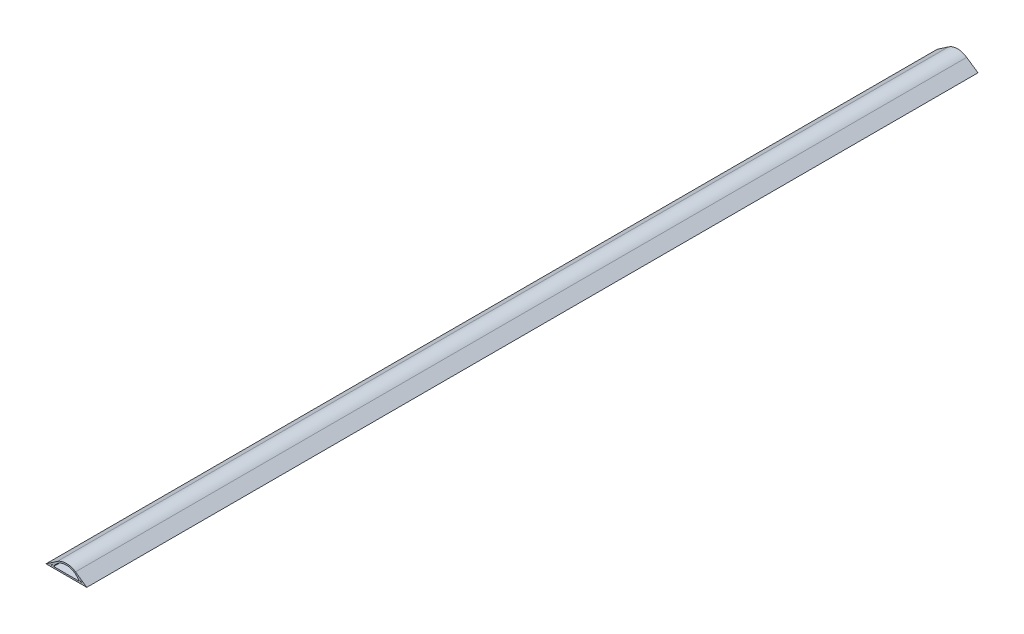
ISO-10303-21;
HEADER;
FILE_DESCRIPTION(('STEP AP214'),'2;1');
FILE_NAME('part.step','',(''),(''),'','','');
FILE_SCHEMA(('AUTOMOTIVE_DESIGN { 1 0 10303 214 1 1 1 1 }'));
ENDSEC;
DATA;
#1=APPLICATION_CONTEXT('core data for automotive mechanical design processes');
#2=APPLICATION_PROTOCOL_DEFINITION('international standard','automotive_design',2000,#1);
#3=PRODUCT_CONTEXT('',#1,'mechanical');
#4=PRODUCT('Part','Part','',(#3));
#5=PRODUCT_RELATED_PRODUCT_CATEGORY('part','',(#4));
#6=PRODUCT_DEFINITION_FORMATION('','',#4);
#7=PRODUCT_DEFINITION_CONTEXT('part definition',#1,'design');
#8=PRODUCT_DEFINITION('design','',#6,#7);
#9=PRODUCT_DEFINITION_SHAPE('','',#8);
#10=(LENGTH_UNIT() NAMED_UNIT(*) SI_UNIT(.MILLI.,.METRE.));
#11=(NAMED_UNIT(*) PLANE_ANGLE_UNIT() SI_UNIT($,.RADIAN.));
#12=(NAMED_UNIT(*) SI_UNIT($,.STERADIAN.) SOLID_ANGLE_UNIT());
#13=UNCERTAINTY_MEASURE_WITH_UNIT(LENGTH_MEASURE(1.E-05),#10,'distance_accuracy_value','');
#14=(GEOMETRIC_REPRESENTATION_CONTEXT(3) GLOBAL_UNCERTAINTY_ASSIGNED_CONTEXT((#13)) GLOBAL_UNIT_ASSIGNED_CONTEXT((#10,
#11,#12)) REPRESENTATION_CONTEXT('',''));
#15=CARTESIAN_POINT('',(0.,0.,0.));
#16=DIRECTION('',(0.,0.,1.));
#17=DIRECTION('',(1.,0.,0.));
#18=AXIS2_PLACEMENT_3D('',#15,#16,#17);
#19=CARTESIAN_POINT('',(34.29,-9.25285714285715,1498.6));
#20=DIRECTION('',(0.,0.,1.));
#21=DIRECTION('',(1.,0.,0.));
#22=AXIS2_PLACEMENT_3D('',#19,#20,#21);
#23=PLANE('',#22);
#24=CARTESIAN_POINT('',(34.29,-9.25285714285715,1498.6));
#25=DIRECTION('',(0.,0.,1.));
#26=DIRECTION('',(1.,0.,0.));
#27=AXIS2_PLACEMENT_3D('',#24,#25,#26);
#28=CIRCLE('',#27,27.0328571428572);
#29=CARTESIAN_POINT('',(49.5873201432242,13.0354214300123,1498.6));
#30=VERTEX_POINT('',#29);
#31=CARTESIAN_POINT('',(18.9926798567758,13.0354214300123,1498.6));
#32=VERTEX_POINT('',#31);
#33=EDGE_CURVE('E187',#30,#32,#28,.T.);
#34=ORIENTED_EDGE('',*,*,#33,.T.);
#35=DIRECTION('',(-0.824488453258394,-0.565878777163079,0.));
#36=VECTOR('',#35,1.);
#37=CARTESIAN_POINT('',(18.9926798567758,13.0354214300123,1498.6));
#38=LINE('',#37,#36);
#39=CARTESIAN_POINT('',(0.,0.,1498.6));
#40=VERTEX_POINT('',#39);
#41=EDGE_CURVE('E190',#32,#40,#38,.T.);
#42=ORIENTED_EDGE('',*,*,#41,.T.);
#43=DIRECTION('',(1.,0.,0.));
#44=VECTOR('',#43,1.);
#45=CARTESIAN_POINT('',(0.,0.,1498.6));
#46=LINE('',#45,#44);
#47=CARTESIAN_POINT('',(68.58,0.,1498.6));
#48=VERTEX_POINT('',#47);
#49=EDGE_CURVE('E193',#40,#48,#46,.T.);
#50=ORIENTED_EDGE('',*,*,#49,.T.);
#51=DIRECTION('',(-0.824488453258394,0.565878777163079,0.));
#52=VECTOR('',#51,1.);
#53=CARTESIAN_POINT('',(49.5873201432242,13.0354214300123,1498.6));
#54=LINE('',#53,#52);
#55=EDGE_CURVE('E195',#48,#30,#54,.T.);
#56=ORIENTED_EDGE('',*,*,#55,.T.);
#57=EDGE_LOOP('',(#34,#42,#50,#56));
#58=FACE_BOUND('',#57,.T.);
#59=CARTESIAN_POINT('',(34.29,-9.25285714285715,1498.6));
#60=DIRECTION('',(0.,0.,-1.));
#61=DIRECTION('',(1.,0.,0.));
#62=AXIS2_PLACEMENT_3D('',#59,#60,#61);
#63=CIRCLE('',#62,27.0328571428572);
#64=CARTESIAN_POINT('',(9.9650357510173,2.54,1498.6));
#65=VERTEX_POINT('',#64);
#66=CARTESIAN_POINT('',(10.9978022708371,4.46752514961934,1498.6));
#67=VERTEX_POINT('',#66);
#68=EDGE_CURVE('E165',#65,#67,#63,.T.);
#69=ORIENTED_EDGE('',*,*,#68,.F.);
#70=DIRECTION('',(1.,0.,0.));
#71=VECTOR('',#70,1.);
#72=CARTESIAN_POINT('',(8.18938765385225,2.54,1498.6));
#73=LINE('',#72,#71);
#74=CARTESIAN_POINT('',(8.18938765385225,2.54,1498.6));
#75=VERTEX_POINT('',#74);
#76=EDGE_CURVE('E163',#75,#65,#73,.T.);
#77=ORIENTED_EDGE('',*,*,#76,.F.);
#78=DIRECTION('',(-0.824488453258395,-0.565878777163076,0.));
#79=VECTOR('',#78,1.);
#80=CARTESIAN_POINT('',(10.9978022708371,4.46752514961934,1498.6));
#81=LINE('',#80,#79);
#82=EDGE_CURVE('E169',#67,#75,#81,.T.);
#83=ORIENTED_EDGE('',*,*,#82,.F.);
#84=EDGE_LOOP('',(#69,#77,#83));
#85=FACE_BOUND('',#84,.T.);
#86=DIRECTION('',(-0.824488453258395,0.565878777163076,0.));
#87=VECTOR('',#86,1.);
#88=CARTESIAN_POINT('',(57.5821977291629,4.46752514961935,1498.6));
#89=LINE('',#88,#87);
#90=CARTESIAN_POINT('',(60.3906123461478,2.54,1498.6));
#91=VERTEX_POINT('',#90);
#92=CARTESIAN_POINT('',(57.5821977291629,4.46752514961936,1498.6));
#93=VERTEX_POINT('',#92);
#94=EDGE_CURVE('E141',#91,#93,#89,.T.);
#95=ORIENTED_EDGE('',*,*,#94,.F.);
#96=DIRECTION('',(1.,0.,0.));
#97=VECTOR('',#96,1.);
#98=CARTESIAN_POINT('',(58.6149642489827,2.54,1498.6));
#99=LINE('',#98,#97);
#100=CARTESIAN_POINT('',(58.6149642489827,2.54,1498.6));
#101=VERTEX_POINT('',#100);
#102=EDGE_CURVE('E139',#101,#91,#99,.T.);
#103=ORIENTED_EDGE('',*,*,#102,.F.);
#104=CARTESIAN_POINT('',(34.29,-9.25285714285715,1498.6));
#105=DIRECTION('',(0.,0.,-1.));
#106=DIRECTION('',(1.,0.,0.));
#107=AXIS2_PLACEMENT_3D('',#104,#105,#106);
#108=CIRCLE('',#107,27.0328571428572);
#109=EDGE_CURVE('E145',#93,#101,#108,.T.);
#110=ORIENTED_EDGE('',*,*,#109,.F.);
#111=EDGE_LOOP('',(#95,#103,#110));
#112=FACE_BOUND('',#111,.T.);
#113=DIRECTION('',(1.,0.,0.));
#114=VECTOR('',#113,1.);
#115=CARTESIAN_POINT('',(12.8230819298957,2.54,1498.6));
#116=LINE('',#115,#114);
#117=CARTESIAN_POINT('',(12.8230819298957,2.54,1498.6));
#118=VERTEX_POINT('',#117);
#119=CARTESIAN_POINT('',(55.7569180701043,2.54,1498.6));
#120=VERTEX_POINT('',#119);
#121=EDGE_CURVE('E122',#118,#120,#116,.T.);
#122=ORIENTED_EDGE('',*,*,#121,.F.);
#123=CARTESIAN_POINT('',(34.29,-9.25285714285715,1498.6));
#124=DIRECTION('',(0.,0.,1.));
#125=DIRECTION('',(1.,0.,0.));
#126=AXIS2_PLACEMENT_3D('',#123,#124,#125);
#127=CIRCLE('',#126,24.4928571428572);
#128=EDGE_CURVE('E128',#120,#118,#127,.T.);
#129=ORIENTED_EDGE('',*,*,#128,.F.);
#130=EDGE_LOOP('',(#122,#129));
#131=FACE_BOUND('',#130,.T.);
#132=ADVANCED_FACE('F34',(#58,#85,#112,#131),#23,.T.);
#133=CARTESIAN_POINT('',(34.29,-9.25285714285715,0.));
#134=DIRECTION('',(0.,0.,1.));
#135=DIRECTION('',(1.,0.,0.));
#136=AXIS2_PLACEMENT_3D('',#133,#134,#135);
#137=PLANE('',#136);
#138=DIRECTION('',(1.,0.,0.));
#139=VECTOR('',#138,1.);
#140=CARTESIAN_POINT('',(58.6149642489827,2.54,0.));
#141=LINE('',#140,#139);
#142=CARTESIAN_POINT('',(58.6149642489827,2.53999999999999,0.));
#143=VERTEX_POINT('',#142);
#144=CARTESIAN_POINT('',(60.3906123461478,2.54,0.));
#145=VERTEX_POINT('',#144);
#146=EDGE_CURVE('E138',#143,#145,#141,.T.);
#147=ORIENTED_EDGE('',*,*,#146,.T.);
#148=DIRECTION('',(-0.824488453258395,0.565878777163076,0.));
#149=VECTOR('',#148,1.);
#150=CARTESIAN_POINT('',(57.5821977291629,4.46752514961935,0.));
#151=LINE('',#150,#149);
#152=CARTESIAN_POINT('',(57.5821977291629,4.46752514961935,0.));
#153=VERTEX_POINT('',#152);
#154=EDGE_CURVE('E150',#145,#153,#151,.T.);
#155=ORIENTED_EDGE('',*,*,#154,.T.);
#156=CARTESIAN_POINT('',(34.29,-9.25285714285715,0.));
#157=DIRECTION('',(0.,0.,-1.));
#158=DIRECTION('',(1.,0.,0.));
#159=AXIS2_PLACEMENT_3D('',#156,#157,#158);
#160=CIRCLE('',#159,27.0328571428572);
#161=EDGE_CURVE('E142',#153,#143,#160,.T.);
#162=ORIENTED_EDGE('',*,*,#161,.T.);
#163=EDGE_LOOP('',(#147,#155,#162));
#164=FACE_BOUND('',#163,.T.);
#165=CARTESIAN_POINT('',(34.29,-9.25285714285715,0.));
#166=DIRECTION('',(0.,0.,1.));
#167=DIRECTION('',(1.,0.,0.));
#168=AXIS2_PLACEMENT_3D('',#165,#166,#167);
#169=CIRCLE('',#168,27.0328571428572);
#170=CARTESIAN_POINT('',(49.5873201432242,13.0354214300123,0.));
#171=VERTEX_POINT('',#170);
#172=CARTESIAN_POINT('',(18.9926798567758,13.0354214300123,0.));
#173=VERTEX_POINT('',#172);
#174=EDGE_CURVE('E186',#171,#173,#169,.T.);
#175=ORIENTED_EDGE('',*,*,#174,.F.);
#176=DIRECTION('',(-0.824488453258394,0.565878777163079,0.));
#177=VECTOR('',#176,1.);
#178=CARTESIAN_POINT('',(49.5873201432242,13.0354214300123,0.));
#179=LINE('',#178,#177);
#180=CARTESIAN_POINT('',(68.58,0.,0.));
#181=VERTEX_POINT('',#180);
#182=EDGE_CURVE('E191',#181,#171,#179,.T.);
#183=ORIENTED_EDGE('',*,*,#182,.F.);
#184=DIRECTION('',(1.,0.,0.));
#185=VECTOR('',#184,1.);
#186=CARTESIAN_POINT('',(0.,0.,0.));
#187=LINE('',#186,#185);
#188=CARTESIAN_POINT('',(0.,0.,0.));
#189=VERTEX_POINT('',#188);
#190=EDGE_CURVE('E202',#189,#181,#187,.T.);
#191=ORIENTED_EDGE('',*,*,#190,.F.);
#192=DIRECTION('',(-0.824488453258394,-0.565878777163079,0.));
#193=VECTOR('',#192,1.);
#194=CARTESIAN_POINT('',(18.9926798567758,13.0354214300123,0.));
#195=LINE('',#194,#193);
#196=EDGE_CURVE('E200',#173,#189,#195,.T.);
#197=ORIENTED_EDGE('',*,*,#196,.F.);
#198=EDGE_LOOP('',(#175,#183,#191,#197));
#199=FACE_BOUND('',#198,.T.);
#200=DIRECTION('',(1.,0.,0.));
#201=VECTOR('',#200,1.);
#202=CARTESIAN_POINT('',(8.18938765385225,2.54,0.));
#203=LINE('',#202,#201);
#204=CARTESIAN_POINT('',(8.18938765385225,2.54,0.));
#205=VERTEX_POINT('',#204);
#206=CARTESIAN_POINT('',(9.9650357510173,2.54,0.));
#207=VERTEX_POINT('',#206);
#208=EDGE_CURVE('E162',#205,#207,#203,.T.);
#209=ORIENTED_EDGE('',*,*,#208,.T.);
#210=CARTESIAN_POINT('',(34.29,-9.25285714285715,0.));
#211=DIRECTION('',(0.,0.,-1.));
#212=DIRECTION('',(1.,0.,0.));
#213=AXIS2_PLACEMENT_3D('',#210,#211,#212);
#214=CIRCLE('',#213,27.0328571428572);
#215=CARTESIAN_POINT('',(10.9978022708371,4.46752514961934,0.));
#216=VERTEX_POINT('',#215);
#217=EDGE_CURVE('E174',#207,#216,#214,.T.);
#218=ORIENTED_EDGE('',*,*,#217,.T.);
#219=DIRECTION('',(-0.824488453258395,-0.565878777163076,0.));
#220=VECTOR('',#219,1.);
#221=CARTESIAN_POINT('',(10.9978022708371,4.46752514961934,0.));
#222=LINE('',#221,#220);
#223=EDGE_CURVE('E166',#216,#205,#222,.T.);
#224=ORIENTED_EDGE('',*,*,#223,.T.);
#225=EDGE_LOOP('',(#209,#218,#224));
#226=FACE_BOUND('',#225,.T.);
#227=CARTESIAN_POINT('',(34.29,-9.25285714285715,0.));
#228=DIRECTION('',(0.,0.,1.));
#229=DIRECTION('',(1.,0.,0.));
#230=AXIS2_PLACEMENT_3D('',#227,#228,#229);
#231=CIRCLE('',#230,24.4928571428572);
#232=CARTESIAN_POINT('',(55.7569180701043,2.54,0.));
#233=VERTEX_POINT('',#232);
#234=CARTESIAN_POINT('',(12.8230819298957,2.54,0.));
#235=VERTEX_POINT('',#234);
#236=EDGE_CURVE('E56',#233,#235,#231,.T.);
#237=ORIENTED_EDGE('',*,*,#236,.T.);
#238=DIRECTION('',(1.,0.,0.));
#239=VECTOR('',#238,1.);
#240=CARTESIAN_POINT('',(12.8230819298957,2.54,0.));
#241=LINE('',#240,#239);
#242=EDGE_CURVE('E132',#235,#233,#241,.T.);
#243=ORIENTED_EDGE('',*,*,#242,.T.);
#244=EDGE_LOOP('',(#237,#243));
#245=FACE_BOUND('',#244,.T.);
#246=ADVANCED_FACE('F220',(#164,#199,#226,#245),#137,.F.);
#247=CARTESIAN_POINT('',(34.29,-9.25285714285715,1498.6));
#248=DIRECTION('',(0.,0.,-1.));
#249=DIRECTION('',(-1.,0.,0.));
#250=AXIS2_PLACEMENT_3D('',#247,#248,#249);
#251=CYLINDRICAL_SURFACE('',#250,27.0328571428572);
#252=ORIENTED_EDGE('',*,*,#174,.T.);
#253=DIRECTION('',(0.,0.,-1.));
#254=VECTOR('',#253,1.);
#255=CARTESIAN_POINT('',(18.9926798567758,13.0354214300123,1498.6));
#256=LINE('',#255,#254);
#257=EDGE_CURVE('E11',#32,#173,#256,.T.);
#258=ORIENTED_EDGE('',*,*,#257,.F.);
#259=ORIENTED_EDGE('',*,*,#33,.F.);
#260=DIRECTION('',(0.,0.,-1.));
#261=VECTOR('',#260,1.);
#262=CARTESIAN_POINT('',(49.5873201432242,13.0354214300123,1498.6));
#263=LINE('',#262,#261);
#264=EDGE_CURVE('E197',#30,#171,#263,.T.);
#265=ORIENTED_EDGE('',*,*,#264,.T.);
#266=EDGE_LOOP('',(#252,#258,#259,#265));
#267=FACE_BOUND('',#266,.T.);
#268=ADVANCED_FACE('F36',(#267),#251,.T.);
#269=CARTESIAN_POINT('',(18.9926798567758,13.0354214300123,1498.6));
#270=DIRECTION('',(0.565878777163079,-0.824488453258394,0.));
#271=DIRECTION('',(0.824488453258394,0.565878777163079,0.));
#272=AXIS2_PLACEMENT_3D('',#269,#270,#271);
#273=PLANE('',#272);
#274=ORIENTED_EDGE('',*,*,#196,.T.);
#275=DIRECTION('',(0.,0.,-1.));
#276=VECTOR('',#275,1.);
#277=CARTESIAN_POINT('',(0.,0.,1498.6));
#278=LINE('',#277,#276);
#279=EDGE_CURVE('E42',#40,#189,#278,.T.);
#280=ORIENTED_EDGE('',*,*,#279,.F.);
#281=ORIENTED_EDGE('',*,*,#41,.F.);
#282=ORIENTED_EDGE('',*,*,#257,.T.);
#283=EDGE_LOOP('',(#274,#280,#281,#282));
#284=FACE_BOUND('',#283,.T.);
#285=ADVANCED_FACE('F231',(#284),#273,.F.);
#286=CARTESIAN_POINT('',(0.,0.,1498.6));
#287=DIRECTION('',(0.,1.,0.));
#288=DIRECTION('',(0.,0.,1.));
#289=AXIS2_PLACEMENT_3D('',#286,#287,#288);
#290=PLANE('',#289);
#291=ORIENTED_EDGE('',*,*,#190,.T.);
#292=DIRECTION('',(0.,0.,-1.));
#293=VECTOR('',#292,1.);
#294=CARTESIAN_POINT('',(68.58,0.,1498.6));
#295=LINE('',#294,#293);
#296=EDGE_CURVE('E207',#48,#181,#295,.T.);
#297=ORIENTED_EDGE('',*,*,#296,.F.);
#298=ORIENTED_EDGE('',*,*,#49,.F.);
#299=ORIENTED_EDGE('',*,*,#279,.T.);
#300=EDGE_LOOP('',(#291,#297,#298,#299));
#301=FACE_BOUND('',#300,.T.);
#302=ADVANCED_FACE('F214',(#301),#290,.F.);
#303=CARTESIAN_POINT('',(49.5873201432242,13.0354214300123,1498.6));
#304=DIRECTION('',(-0.565878777163079,-0.824488453258394,0.));
#305=DIRECTION('',(0.824488453258394,-0.565878777163079,0.));
#306=AXIS2_PLACEMENT_3D('',#303,#304,#305);
#307=PLANE('',#306);
#308=ORIENTED_EDGE('',*,*,#182,.T.);
#309=ORIENTED_EDGE('',*,*,#264,.F.);
#310=ORIENTED_EDGE('',*,*,#55,.F.);
#311=ORIENTED_EDGE('',*,*,#296,.T.);
#312=EDGE_LOOP('',(#308,#309,#310,#311));
#313=FACE_BOUND('',#312,.T.);
#314=ADVANCED_FACE('F224',(#313),#307,.F.);
#315=CARTESIAN_POINT('',(8.18938765385225,2.54,1498.6));
#316=DIRECTION('',(0.,1.,0.));
#317=DIRECTION('',(-1.,0.,0.));
#318=AXIS2_PLACEMENT_3D('',#315,#316,#317);
#319=PLANE('',#318);
#320=ORIENTED_EDGE('',*,*,#208,.F.);
#321=DIRECTION('',(0.,0.,-1.));
#322=VECTOR('',#321,1.);
#323=CARTESIAN_POINT('',(8.18938765385225,2.54,1498.6));
#324=LINE('',#323,#322);
#325=EDGE_CURVE('E171',#75,#205,#324,.T.);
#326=ORIENTED_EDGE('',*,*,#325,.F.);
#327=ORIENTED_EDGE('',*,*,#76,.T.);
#328=DIRECTION('',(0.,0.,-1.));
#329=VECTOR('',#328,1.);
#330=CARTESIAN_POINT('',(9.9650357510173,2.54,1498.6));
#331=LINE('',#330,#329);
#332=EDGE_CURVE('E183',#65,#207,#331,.T.);
#333=ORIENTED_EDGE('',*,*,#332,.T.);
#334=EDGE_LOOP('',(#320,#326,#327,#333));
#335=FACE_BOUND('',#334,.T.);
#336=ADVANCED_FACE('F246',(#335),#319,.T.);
#337=CARTESIAN_POINT('',(34.29,-9.25285714285715,1498.6));
#338=DIRECTION('',(0.,0.,-1.));
#339=DIRECTION('',(-1.,0.,0.));
#340=AXIS2_PLACEMENT_3D('',#337,#338,#339);
#341=CYLINDRICAL_SURFACE('',#340,27.0328571428572);
#342=ORIENTED_EDGE('',*,*,#217,.F.);
#343=ORIENTED_EDGE('',*,*,#332,.F.);
#344=ORIENTED_EDGE('',*,*,#68,.T.);
#345=DIRECTION('',(0.,0.,-1.));
#346=VECTOR('',#345,1.);
#347=CARTESIAN_POINT('',(10.9978022708371,4.46752514961934,1498.6));
#348=LINE('',#347,#346);
#349=EDGE_CURVE('E181',#67,#216,#348,.T.);
#350=ORIENTED_EDGE('',*,*,#349,.T.);
#351=EDGE_LOOP('',(#342,#343,#344,#350));
#352=FACE_BOUND('',#351,.T.);
#353=ADVANCED_FACE('F253',(#352),#341,.T.);
#354=CARTESIAN_POINT('',(10.9978022708371,4.46752514961934,1498.6));
#355=DIRECTION('',(0.565878777163076,-0.824488453258395,0.));
#356=DIRECTION('',(0.824488453258396,0.565878777163077,0.));
#357=AXIS2_PLACEMENT_3D('',#354,#355,#356);
#358=PLANE('',#357);
#359=ORIENTED_EDGE('',*,*,#223,.F.);
#360=ORIENTED_EDGE('',*,*,#349,.F.);
#361=ORIENTED_EDGE('',*,*,#82,.T.);
#362=ORIENTED_EDGE('',*,*,#325,.T.);
#363=EDGE_LOOP('',(#359,#360,#361,#362));
#364=FACE_BOUND('',#363,.T.);
#365=ADVANCED_FACE('F258',(#364),#358,.T.);
#366=CARTESIAN_POINT('',(58.6149642489827,2.54,1498.6));
#367=DIRECTION('',(0.,1.,0.));
#368=DIRECTION('',(-1.,0.,0.));
#369=AXIS2_PLACEMENT_3D('',#366,#367,#368);
#370=PLANE('',#369);
#371=ORIENTED_EDGE('',*,*,#146,.F.);
#372=DIRECTION('',(0.,0.,-1.));
#373=VECTOR('',#372,1.);
#374=CARTESIAN_POINT('',(58.6149642489827,2.54,1498.6));
#375=LINE('',#374,#373);
#376=EDGE_CURVE('E147',#101,#143,#375,.T.);
#377=ORIENTED_EDGE('',*,*,#376,.F.);
#378=ORIENTED_EDGE('',*,*,#102,.T.);
#379=DIRECTION('',(0.,0.,-1.));
#380=VECTOR('',#379,1.);
#381=CARTESIAN_POINT('',(60.3906123461478,2.54,1498.6));
#382=LINE('',#381,#380);
#383=EDGE_CURVE('E159',#91,#145,#382,.T.);
#384=ORIENTED_EDGE('',*,*,#383,.T.);
#385=EDGE_LOOP('',(#371,#377,#378,#384));
#386=FACE_BOUND('',#385,.T.);
#387=ADVANCED_FACE('F277',(#386),#370,.T.);
#388=CARTESIAN_POINT('',(57.5821977291629,4.46752514961935,1498.6));
#389=DIRECTION('',(-0.565878777163076,-0.824488453258395,0.));
#390=DIRECTION('',(0.824488453258396,-0.565878777163076,0.));
#391=AXIS2_PLACEMENT_3D('',#388,#389,#390);
#392=PLANE('',#391);
#393=ORIENTED_EDGE('',*,*,#154,.F.);
#394=ORIENTED_EDGE('',*,*,#383,.F.);
#395=ORIENTED_EDGE('',*,*,#94,.T.);
#396=DIRECTION('',(0.,0.,-1.));
#397=VECTOR('',#396,1.);
#398=CARTESIAN_POINT('',(57.5821977291629,4.46752514961935,1498.6));
#399=LINE('',#398,#397);
#400=EDGE_CURVE('E157',#93,#153,#399,.T.);
#401=ORIENTED_EDGE('',*,*,#400,.T.);
#402=EDGE_LOOP('',(#393,#394,#395,#401));
#403=FACE_BOUND('',#402,.T.);
#404=ADVANCED_FACE('F274',(#403),#392,.T.);
#405=CARTESIAN_POINT('',(34.29,-9.25285714285715,1498.6));
#406=DIRECTION('',(0.,0.,-1.));
#407=DIRECTION('',(-1.,0.,0.));
#408=AXIS2_PLACEMENT_3D('',#405,#406,#407);
#409=CYLINDRICAL_SURFACE('',#408,27.0328571428572);
#410=ORIENTED_EDGE('',*,*,#161,.F.);
#411=ORIENTED_EDGE('',*,*,#400,.F.);
#412=ORIENTED_EDGE('',*,*,#109,.T.);
#413=ORIENTED_EDGE('',*,*,#376,.T.);
#414=EDGE_LOOP('',(#410,#411,#412,#413));
#415=FACE_BOUND('',#414,.T.);
#416=ADVANCED_FACE('F280',(#415),#409,.T.);
#417=CARTESIAN_POINT('',(34.29,-9.25285714285715,1498.6));
#418=DIRECTION('',(0.,0.,-1.));
#419=DIRECTION('',(-1.,0.,0.));
#420=AXIS2_PLACEMENT_3D('',#417,#418,#419);
#421=CYLINDRICAL_SURFACE('',#420,24.4928571428572);
#422=ORIENTED_EDGE('',*,*,#236,.F.);
#423=DIRECTION('',(0.,0.,-1.));
#424=VECTOR('',#423,1.);
#425=CARTESIAN_POINT('',(55.7569180701043,2.54,1498.6));
#426=LINE('',#425,#424);
#427=EDGE_CURVE('E124',#120,#233,#426,.T.);
#428=ORIENTED_EDGE('',*,*,#427,.F.);
#429=ORIENTED_EDGE('',*,*,#128,.T.);
#430=DIRECTION('',(0.,0.,-1.));
#431=VECTOR('',#430,1.);
#432=CARTESIAN_POINT('',(12.8230819298957,2.54,1498.6));
#433=LINE('',#432,#431);
#434=EDGE_CURVE('E49',#118,#235,#433,.T.);
#435=ORIENTED_EDGE('',*,*,#434,.T.);
#436=EDGE_LOOP('',(#422,#428,#429,#435));
#437=FACE_BOUND('',#436,.T.);
#438=ADVANCED_FACE('F130',(#437),#421,.F.);
#439=CARTESIAN_POINT('',(12.8230819298957,2.54,1498.6));
#440=DIRECTION('',(0.,1.,0.));
#441=DIRECTION('',(0.,0.,1.));
#442=AXIS2_PLACEMENT_3D('',#439,#440,#441);
#443=PLANE('',#442);
#444=ORIENTED_EDGE('',*,*,#242,.F.);
#445=ORIENTED_EDGE('',*,*,#434,.F.);
#446=ORIENTED_EDGE('',*,*,#121,.T.);
#447=ORIENTED_EDGE('',*,*,#427,.T.);
#448=EDGE_LOOP('',(#444,#445,#446,#447));
#449=FACE_BOUND('',#448,.T.);
#450=ADVANCED_FACE('F123',(#449),#443,.T.);
#451=CLOSED_SHELL('',(#132,#246,#268,#285,#302,#314,#336,#353,#365,#387,#404,#416,#438,#450));
#452=MANIFOLD_SOLID_BREP('B2',#451);
#453=ADVANCED_BREP_SHAPE_REPRESENTATION('',(#18,#452),#14);
#454=SHAPE_DEFINITION_REPRESENTATION(#9,#453);
ENDSEC;
END-ISO-10303-21;
